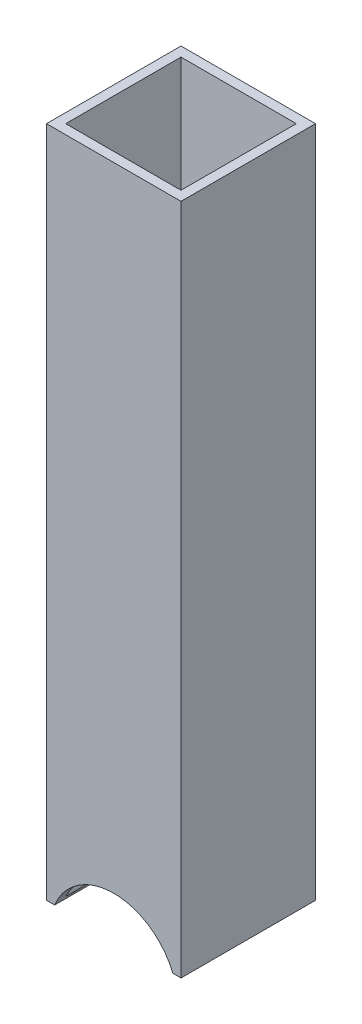
ISO-10303-21;
HEADER;
FILE_DESCRIPTION(('STEP AP214'),'2;1');
FILE_NAME('part.step','',(''),(''),'','','');
FILE_SCHEMA(('AUTOMOTIVE_DESIGN { 1 0 10303 214 1 1 1 1 }'));
ENDSEC;
DATA;
#1=APPLICATION_CONTEXT('core data for automotive mechanical design processes');
#2=APPLICATION_PROTOCOL_DEFINITION('international standard','automotive_design',2000,#1);
#3=PRODUCT_CONTEXT('',#1,'mechanical');
#4=PRODUCT('Part','Part','',(#3));
#5=PRODUCT_RELATED_PRODUCT_CATEGORY('part','',(#4));
#6=PRODUCT_DEFINITION_FORMATION('','',#4);
#7=PRODUCT_DEFINITION_CONTEXT('part definition',#1,'design');
#8=PRODUCT_DEFINITION('design','',#6,#7);
#9=PRODUCT_DEFINITION_SHAPE('','',#8);
#10=(LENGTH_UNIT() NAMED_UNIT(*) SI_UNIT(.MILLI.,.METRE.));
#11=(NAMED_UNIT(*) PLANE_ANGLE_UNIT() SI_UNIT($,.RADIAN.));
#12=(NAMED_UNIT(*) SI_UNIT($,.STERADIAN.) SOLID_ANGLE_UNIT());
#13=UNCERTAINTY_MEASURE_WITH_UNIT(LENGTH_MEASURE(1.E-05),#10,'distance_accuracy_value','');
#14=(GEOMETRIC_REPRESENTATION_CONTEXT(3) GLOBAL_UNCERTAINTY_ASSIGNED_CONTEXT((#13)) GLOBAL_UNIT_ASSIGNED_CONTEXT((#10,
#11,#12)) REPRESENTATION_CONTEXT('',''));
#15=CARTESIAN_POINT('',(0.,0.,0.));
#16=DIRECTION('',(0.,0.,1.));
#17=DIRECTION('',(1.,0.,0.));
#18=AXIS2_PLACEMENT_3D('',#15,#16,#17);
#19=CARTESIAN_POINT('',(0.,-127.,1.33226762955019E-12));
#20=DIRECTION('',(0.,-1.,0.));
#21=DIRECTION('',(0.,0.,-1.));
#22=AXIS2_PLACEMENT_3D('',#19,#20,#21);
#23=PLANE('',#22);
#24=DIRECTION('',(0.,0.,1.));
#25=VECTOR('',#24,1.);
#26=CARTESIAN_POINT('',(19.5306635255947,-127.,-22.2249999999973));
#27=LINE('',#26,#25);
#28=CARTESIAN_POINT('',(19.5306635255947,-127.,-22.2249999999973));
#29=VERTEX_POINT('',#28);
#30=CARTESIAN_POINT('',(19.5306635255948,-127.,22.2250000000013));
#31=VERTEX_POINT('',#30);
#32=EDGE_CURVE('E11',#29,#31,#27,.T.);
#33=ORIENTED_EDGE('',*,*,#32,.F.);
#34=DIRECTION('',(0.999999999999995,0.,0.));
#35=VECTOR('',#34,1.);
#36=CARTESIAN_POINT('',(-22.2249999999998,-127.,-22.2249999999973));
#37=LINE('',#36,#35);
#38=CARTESIAN_POINT('',(22.2249999999998,-127.,-22.2249999999973));
#39=VERTEX_POINT('',#38);
#40=EDGE_CURVE('E208',#29,#39,#37,.T.);
#41=ORIENTED_EDGE('',*,*,#40,.T.);
#42=DIRECTION('',(0.,0.,1.));
#43=VECTOR('',#42,1.);
#44=CARTESIAN_POINT('',(22.2249999999998,-127.,-22.2249999999973));
#45=LINE('',#44,#43);
#46=CARTESIAN_POINT('',(22.225,-127.,22.2250000000013));
#47=VERTEX_POINT('',#46);
#48=EDGE_CURVE('E132',#39,#47,#45,.T.);
#49=ORIENTED_EDGE('',*,*,#48,.T.);
#50=DIRECTION('',(-0.999999999999995,0.,0.));
#51=VECTOR('',#50,1.);
#52=CARTESIAN_POINT('',(22.225,-127.,22.2250000000013));
#53=LINE('',#52,#51);
#54=EDGE_CURVE('E125',#47,#31,#53,.T.);
#55=ORIENTED_EDGE('',*,*,#54,.T.);
#56=EDGE_LOOP('',(#33,#41,#49,#55));
#57=FACE_BOUND('',#56,.T.);
#58=ADVANCED_FACE('F40',(#57),#23,.T.);
#59=CARTESIAN_POINT('',(22.225,-95.25,22.2250000000013));
#60=DIRECTION('',(0.999999999999995,0.,0.));
#61=DIRECTION('',(0.,0.,-1.));
#62=AXIS2_PLACEMENT_3D('',#59,#60,#61);
#63=PLANE('',#62);
#64=DIRECTION('',(0.,1.,0.));
#65=VECTOR('',#64,1.);
#66=CARTESIAN_POINT('',(22.2249999999998,-95.25,-22.225));
#67=LINE('',#66,#65);
#68=CARTESIAN_POINT('',(22.2249999999998,95.2499999999987,-22.225));
#69=VERTEX_POINT('',#68);
#70=EDGE_CURVE('E180',#39,#69,#67,.T.);
#71=ORIENTED_EDGE('',*,*,#70,.T.);
#72=DIRECTION('',(0.,0.,-1.));
#73=VECTOR('',#72,1.);
#74=CARTESIAN_POINT('',(22.225,95.25,22.225));
#75=LINE('',#74,#73);
#76=CARTESIAN_POINT('',(22.225,95.25,22.225));
#77=VERTEX_POINT('',#76);
#78=EDGE_CURVE('E160',#77,#69,#75,.T.);
#79=ORIENTED_EDGE('',*,*,#78,.F.);
#80=DIRECTION('',(0.,1.,0.));
#81=VECTOR('',#80,1.);
#82=CARTESIAN_POINT('',(22.225,-95.25,22.2250000000013));
#83=LINE('',#82,#81);
#84=EDGE_CURVE('E189',#47,#77,#83,.T.);
#85=ORIENTED_EDGE('',*,*,#84,.F.);
#86=ORIENTED_EDGE('',*,*,#48,.F.);
#87=EDGE_LOOP('',(#71,#79,#85,#86));
#88=FACE_BOUND('',#87,.T.);
#89=ADVANCED_FACE('F42',(#88),#63,.T.);
#90=CARTESIAN_POINT('',(-22.2249999999997,-95.25,22.2250000000013));
#91=DIRECTION('',(0.,0.,1.));
#92=DIRECTION('',(0.999999999999995,0.,0.));
#93=AXIS2_PLACEMENT_3D('',#90,#91,#92);
#94=PLANE('',#93);
#95=CARTESIAN_POINT('',(0.,-134.9375,22.2250000000013));
#96=DIRECTION('',(0.,0.,1.));
#97=DIRECTION('',(0.999999999999995,0.,0.));
#98=AXIS2_PLACEMENT_3D('',#95,#96,#97);
#99=CIRCLE('',#98,21.082);
#100=CARTESIAN_POINT('',(-19.5306635255945,-127.,22.2250000000013));
#101=VERTEX_POINT('',#100);
#102=EDGE_CURVE('E63',#31,#101,#99,.T.);
#103=ORIENTED_EDGE('',*,*,#102,.F.);
#104=ORIENTED_EDGE('',*,*,#54,.F.);
#105=ORIENTED_EDGE('',*,*,#84,.T.);
#106=DIRECTION('',(0.999999999999995,0.,0.));
#107=VECTOR('',#106,1.);
#108=CARTESIAN_POINT('',(-22.2249999999997,95.25,22.225));
#109=LINE('',#108,#107);
#110=CARTESIAN_POINT('',(-22.2249999999997,95.25,22.225));
#111=VERTEX_POINT('',#110);
#112=EDGE_CURVE('E172',#111,#77,#109,.T.);
#113=ORIENTED_EDGE('',*,*,#112,.F.);
#114=DIRECTION('',(0.,1.,0.));
#115=VECTOR('',#114,1.);
#116=CARTESIAN_POINT('',(-22.2249999999997,-95.25,22.2250000000013));
#117=LINE('',#116,#115);
#118=CARTESIAN_POINT('',(-22.2249999999997,-127.,22.2250000000013));
#119=VERTEX_POINT('',#118);
#120=EDGE_CURVE('E192',#119,#111,#117,.T.);
#121=ORIENTED_EDGE('',*,*,#120,.F.);
#122=EDGE_CURVE('E127',#101,#119,#53,.T.);
#123=ORIENTED_EDGE('',*,*,#122,.F.);
#124=EDGE_LOOP('',(#103,#104,#105,#113,#121,#123));
#125=FACE_BOUND('',#124,.T.);
#126=ADVANCED_FACE('F124',(#125),#94,.T.);
#127=CARTESIAN_POINT('',(-22.2249999999997,-95.25,22.2250000000013));
#128=DIRECTION('',(-0.999999999999995,0.,0.));
#129=DIRECTION('',(0.,0.,1.));
#130=AXIS2_PLACEMENT_3D('',#127,#128,#129);
#131=PLANE('',#130);
#132=ORIENTED_EDGE('',*,*,#120,.T.);
#133=DIRECTION('',(0.,0.,1.));
#134=VECTOR('',#133,1.);
#135=CARTESIAN_POINT('',(-22.2249999999997,95.25,22.225));
#136=LINE('',#135,#134);
#137=CARTESIAN_POINT('',(-22.2249999999998,95.2499999999987,-22.225));
#138=VERTEX_POINT('',#137);
#139=EDGE_CURVE('E168',#138,#111,#136,.T.);
#140=ORIENTED_EDGE('',*,*,#139,.F.);
#141=DIRECTION('',(0.,1.,0.));
#142=VECTOR('',#141,1.);
#143=CARTESIAN_POINT('',(-22.2249999999998,-95.25,-22.225));
#144=LINE('',#143,#142);
#145=CARTESIAN_POINT('',(-22.2249999999998,-127.,-22.2249999999973));
#146=VERTEX_POINT('',#145);
#147=EDGE_CURVE('E195',#146,#138,#144,.T.);
#148=ORIENTED_EDGE('',*,*,#147,.F.);
#149=DIRECTION('',(0.,0.,-1.));
#150=VECTOR('',#149,1.);
#151=CARTESIAN_POINT('',(-22.2249999999997,-127.,22.2250000000013));
#152=LINE('',#151,#150);
#153=EDGE_CURVE('E134',#119,#146,#152,.T.);
#154=ORIENTED_EDGE('',*,*,#153,.F.);
#155=EDGE_LOOP('',(#132,#140,#148,#154));
#156=FACE_BOUND('',#155,.T.);
#157=ADVANCED_FACE('F280',(#156),#131,.T.);
#158=CARTESIAN_POINT('',(-22.2249999999998,-95.25,-22.225));
#159=DIRECTION('',(0.,0.,-1.));
#160=DIRECTION('',(-0.999999999999995,0.,0.));
#161=AXIS2_PLACEMENT_3D('',#158,#159,#160);
#162=PLANE('',#161);
#163=CARTESIAN_POINT('',(0.,-134.9375,-22.2249999999973));
#164=DIRECTION('',(0.,0.,1.));
#165=DIRECTION('',(0.999999999999995,0.,0.));
#166=AXIS2_PLACEMENT_3D('',#163,#164,#165);
#167=CIRCLE('',#166,21.082);
#168=CARTESIAN_POINT('',(-19.5306635255947,-127.,-22.2249999999973));
#169=VERTEX_POINT('',#168);
#170=EDGE_CURVE('E117',#29,#169,#167,.T.);
#171=ORIENTED_EDGE('',*,*,#170,.T.);
#172=EDGE_CURVE('E206',#146,#169,#37,.T.);
#173=ORIENTED_EDGE('',*,*,#172,.F.);
#174=ORIENTED_EDGE('',*,*,#147,.T.);
#175=DIRECTION('',(-0.999999999999995,0.,0.));
#176=VECTOR('',#175,1.);
#177=CARTESIAN_POINT('',(-22.2249999999998,95.2499999999987,-22.225));
#178=LINE('',#177,#176);
#179=EDGE_CURVE('E164',#69,#138,#178,.T.);
#180=ORIENTED_EDGE('',*,*,#179,.F.);
#181=ORIENTED_EDGE('',*,*,#70,.F.);
#182=ORIENTED_EDGE('',*,*,#40,.F.);
#183=EDGE_LOOP('',(#171,#173,#174,#180,#181,#182));
#184=FACE_BOUND('',#183,.T.);
#185=ADVANCED_FACE('F205',(#184),#162,.T.);
#186=CARTESIAN_POINT('',(19.05,-95.25,19.0500000000013));
#187=DIRECTION('',(0.999999999999995,0.,0.));
#188=DIRECTION('',(0.,0.,-1.));
#189=AXIS2_PLACEMENT_3D('',#186,#187,#188);
#190=PLANE('',#189);
#191=DIRECTION('',(0.,1.,0.));
#192=VECTOR('',#191,1.);
#193=CARTESIAN_POINT('',(19.0499999999998,-95.25,-19.0500000000001));
#194=LINE('',#193,#192);
#195=CARTESIAN_POINT('',(19.0499999999998,-125.907094472007,-19.0499999999974));
#196=VERTEX_POINT('',#195);
#197=CARTESIAN_POINT('',(19.0499999999998,95.2499999999987,-19.05));
#198=VERTEX_POINT('',#197);
#199=EDGE_CURVE('E176',#196,#198,#194,.T.);
#200=ORIENTED_EDGE('',*,*,#199,.F.);
#201=DIRECTION('',(0.,0.,1.));
#202=VECTOR('',#201,1.);
#203=CARTESIAN_POINT('',(19.0499999999998,-125.907094472007,-22.2249999999973));
#204=LINE('',#203,#202);
#205=CARTESIAN_POINT('',(19.05,-125.907094472007,19.0500000000013));
#206=VERTEX_POINT('',#205);
#207=EDGE_CURVE('E56',#196,#206,#204,.T.);
#208=ORIENTED_EDGE('',*,*,#207,.T.);
#209=DIRECTION('',(0.,1.,0.));
#210=VECTOR('',#209,1.);
#211=CARTESIAN_POINT('',(19.05,-95.25,19.0500000000013));
#212=LINE('',#211,#210);
#213=CARTESIAN_POINT('',(19.05,95.25,19.05));
#214=VERTEX_POINT('',#213);
#215=EDGE_CURVE('E177',#206,#214,#212,.T.);
#216=ORIENTED_EDGE('',*,*,#215,.T.);
#217=DIRECTION('',(0.,0.,-1.));
#218=VECTOR('',#217,1.);
#219=CARTESIAN_POINT('',(19.05,95.25,19.05));
#220=LINE('',#219,#218);
#221=EDGE_CURVE('E140',#214,#198,#220,.T.);
#222=ORIENTED_EDGE('',*,*,#221,.T.);
#223=EDGE_LOOP('',(#200,#208,#216,#222));
#224=FACE_BOUND('',#223,.T.);
#225=ADVANCED_FACE('F236',(#224),#190,.F.);
#226=CARTESIAN_POINT('',(-19.0499999999997,-95.25,19.0500000000013));
#227=DIRECTION('',(0.,0.,1.));
#228=DIRECTION('',(0.999999999999995,0.,0.));
#229=AXIS2_PLACEMENT_3D('',#226,#227,#228);
#230=PLANE('',#229);
#231=ORIENTED_EDGE('',*,*,#215,.F.);
#232=CARTESIAN_POINT('',(0.,-134.9375,19.0500000000013));
#233=DIRECTION('',(0.,0.,1.));
#234=DIRECTION('',(0.999999999999995,0.,0.));
#235=AXIS2_PLACEMENT_3D('',#232,#233,#234);
#236=CIRCLE('',#235,21.082);
#237=CARTESIAN_POINT('',(-19.0499999999997,-125.907094472007,19.0500000000013));
#238=VERTEX_POINT('',#237);
#239=EDGE_CURVE('E221',#206,#238,#236,.T.);
#240=ORIENTED_EDGE('',*,*,#239,.T.);
#241=DIRECTION('',(0.,1.,0.));
#242=VECTOR('',#241,1.);
#243=CARTESIAN_POINT('',(-19.0499999999997,-95.25,19.0500000000013));
#244=LINE('',#243,#242);
#245=CARTESIAN_POINT('',(-19.0499999999997,95.25,19.05));
#246=VERTEX_POINT('',#245);
#247=EDGE_CURVE('E181',#238,#246,#244,.T.);
#248=ORIENTED_EDGE('',*,*,#247,.T.);
#249=DIRECTION('',(0.999999999999995,0.,0.));
#250=VECTOR('',#249,1.);
#251=CARTESIAN_POINT('',(-19.0499999999997,95.25,19.05));
#252=LINE('',#251,#250);
#253=EDGE_CURVE('E156',#246,#214,#252,.T.);
#254=ORIENTED_EDGE('',*,*,#253,.T.);
#255=EDGE_LOOP('',(#231,#240,#248,#254));
#256=FACE_BOUND('',#255,.T.);
#257=ADVANCED_FACE('F248',(#256),#230,.F.);
#258=CARTESIAN_POINT('',(-19.0499999999997,-95.25,19.0500000000013));
#259=DIRECTION('',(-0.999999999999995,0.,0.));
#260=DIRECTION('',(0.,0.,1.));
#261=AXIS2_PLACEMENT_3D('',#258,#259,#260);
#262=PLANE('',#261);
#263=ORIENTED_EDGE('',*,*,#247,.F.);
#264=DIRECTION('',(0.,0.,1.));
#265=VECTOR('',#264,1.);
#266=CARTESIAN_POINT('',(-19.0499999999998,-125.907094472007,-22.2249999999973));
#267=LINE('',#266,#265);
#268=CARTESIAN_POINT('',(-19.0499999999998,-125.907094472007,-19.0499999999974));
#269=VERTEX_POINT('',#268);
#270=EDGE_CURVE('E225',#238,#269,#267,.F.);
#271=ORIENTED_EDGE('',*,*,#270,.T.);
#272=DIRECTION('',(0.,1.,0.));
#273=VECTOR('',#272,1.);
#274=CARTESIAN_POINT('',(-19.0499999999998,-95.25,-19.0500000000001));
#275=LINE('',#274,#273);
#276=CARTESIAN_POINT('',(-19.0499999999998,95.2499999999987,-19.05));
#277=VERTEX_POINT('',#276);
#278=EDGE_CURVE('E184',#269,#277,#275,.T.);
#279=ORIENTED_EDGE('',*,*,#278,.T.);
#280=DIRECTION('',(0.,0.,1.));
#281=VECTOR('',#280,1.);
#282=CARTESIAN_POINT('',(-19.0499999999997,95.25,19.05));
#283=LINE('',#282,#281);
#284=EDGE_CURVE('E152',#277,#246,#283,.T.);
#285=ORIENTED_EDGE('',*,*,#284,.T.);
#286=EDGE_LOOP('',(#263,#271,#279,#285));
#287=FACE_BOUND('',#286,.T.);
#288=ADVANCED_FACE('F246',(#287),#262,.F.);
#289=CARTESIAN_POINT('',(-19.0499999999998,-95.25,-19.0500000000001));
#290=DIRECTION('',(0.,0.,-1.));
#291=DIRECTION('',(-0.999999999999995,0.,0.));
#292=AXIS2_PLACEMENT_3D('',#289,#290,#291);
#293=PLANE('',#292);
#294=ORIENTED_EDGE('',*,*,#278,.F.);
#295=CARTESIAN_POINT('',(0.,-134.9375,-19.0499999999974));
#296=DIRECTION('',(0.,0.,-1.));
#297=DIRECTION('',(-0.999999999999995,0.,0.));
#298=AXIS2_PLACEMENT_3D('',#295,#296,#297);
#299=CIRCLE('',#298,21.082);
#300=EDGE_CURVE('E210',#269,#196,#299,.T.);
#301=ORIENTED_EDGE('',*,*,#300,.T.);
#302=ORIENTED_EDGE('',*,*,#199,.T.);
#303=DIRECTION('',(-0.999999999999995,0.,0.));
#304=VECTOR('',#303,1.);
#305=CARTESIAN_POINT('',(-19.0499999999998,95.2499999999987,-19.05));
#306=LINE('',#305,#304);
#307=EDGE_CURVE('E148',#198,#277,#306,.T.);
#308=ORIENTED_EDGE('',*,*,#307,.T.);
#309=EDGE_LOOP('',(#294,#301,#302,#308));
#310=FACE_BOUND('',#309,.T.);
#311=ADVANCED_FACE('F234',(#310),#293,.F.);
#312=CARTESIAN_POINT('',(0.,95.25,0.));
#313=DIRECTION('',(0.,-1.,0.));
#314=DIRECTION('',(0.,0.,-1.));
#315=AXIS2_PLACEMENT_3D('',#312,#313,#314);
#316=PLANE('',#315);
#317=ORIENTED_EDGE('',*,*,#78,.T.);
#318=ORIENTED_EDGE('',*,*,#179,.T.);
#319=ORIENTED_EDGE('',*,*,#139,.T.);
#320=ORIENTED_EDGE('',*,*,#112,.T.);
#321=EDGE_LOOP('',(#317,#318,#319,#320));
#322=FACE_BOUND('',#321,.T.);
#323=ORIENTED_EDGE('',*,*,#221,.F.);
#324=ORIENTED_EDGE('',*,*,#253,.F.);
#325=ORIENTED_EDGE('',*,*,#284,.F.);
#326=ORIENTED_EDGE('',*,*,#307,.F.);
#327=EDGE_LOOP('',(#323,#324,#325,#326));
#328=FACE_BOUND('',#327,.T.);
#329=ADVANCED_FACE('F243',(#322,#328),#316,.F.);
#330=DIRECTION('',(0.,0.,1.));
#331=VECTOR('',#330,1.);
#332=CARTESIAN_POINT('',(-19.5306635255947,-127.,-22.2249999999973));
#333=LINE('',#332,#331);
#334=EDGE_CURVE('E49',#101,#169,#333,.F.);
#335=ORIENTED_EDGE('',*,*,#334,.F.);
#336=ORIENTED_EDGE('',*,*,#122,.T.);
#337=ORIENTED_EDGE('',*,*,#153,.T.);
#338=ORIENTED_EDGE('',*,*,#172,.T.);
#339=EDGE_LOOP('',(#335,#336,#337,#338));
#340=FACE_BOUND('',#339,.T.);
#341=ADVANCED_FACE('F212',(#340),#23,.T.);
#342=CARTESIAN_POINT('',(0.,-134.9375,-22.2249999999973));
#343=DIRECTION('',(0.,0.,1.));
#344=DIRECTION('',(0.999999999999995,0.,0.));
#345=AXIS2_PLACEMENT_3D('',#342,#343,#344);
#346=CYLINDRICAL_SURFACE('',#345,21.082);
#347=ORIENTED_EDGE('',*,*,#32,.T.);
#348=ORIENTED_EDGE('',*,*,#102,.T.);
#349=ORIENTED_EDGE('',*,*,#334,.T.);
#350=ORIENTED_EDGE('',*,*,#170,.F.);
#351=EDGE_LOOP('',(#347,#348,#349,#350));
#352=FACE_BOUND('',#351,.T.);
#353=ORIENTED_EDGE('',*,*,#300,.F.);
#354=ORIENTED_EDGE('',*,*,#270,.F.);
#355=ORIENTED_EDGE('',*,*,#239,.F.);
#356=ORIENTED_EDGE('',*,*,#207,.F.);
#357=EDGE_LOOP('',(#353,#354,#355,#356));
#358=FACE_BOUND('',#357,.T.);
#359=ADVANCED_FACE('F115',(#352,#358),#346,.F.);
#360=CLOSED_SHELL('',(#58,#89,#126,#157,#185,#225,#257,#288,#311,#329,#341,#359));
#361=MANIFOLD_SOLID_BREP('B2',#360);
#362=ADVANCED_BREP_SHAPE_REPRESENTATION('',(#18,#361),#14);
#363=SHAPE_DEFINITION_REPRESENTATION(#9,#362);
ENDSEC;
END-ISO-10303-21;
